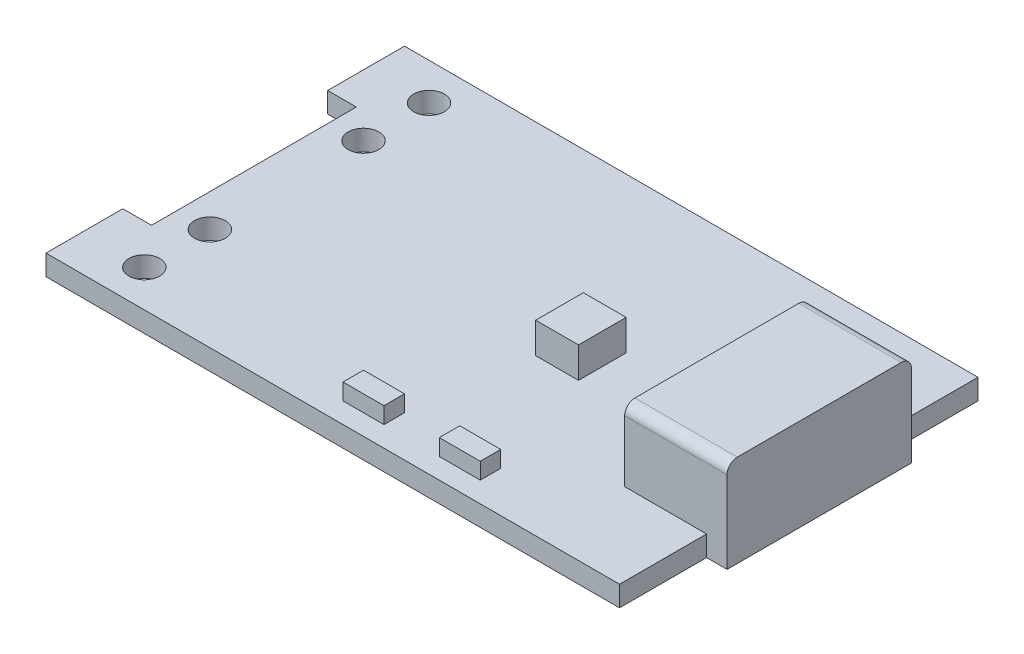
ISO-10303-21;
HEADER;
FILE_DESCRIPTION(('STEP AP214'),'2;1');
FILE_NAME('part.step','',(''),(''),'','','');
FILE_SCHEMA(('AUTOMOTIVE_DESIGN { 1 0 10303 214 1 1 1 1 }'));
ENDSEC;
DATA;
#1=APPLICATION_CONTEXT('core data for automotive mechanical design processes');
#2=APPLICATION_PROTOCOL_DEFINITION('international standard','automotive_design',2000,#1);
#3=PRODUCT_CONTEXT('',#1,'mechanical');
#4=PRODUCT('Part','Part','',(#3));
#5=PRODUCT_RELATED_PRODUCT_CATEGORY('part','',(#4));
#6=PRODUCT_DEFINITION_FORMATION('','',#4);
#7=PRODUCT_DEFINITION_CONTEXT('part definition',#1,'design');
#8=PRODUCT_DEFINITION('design','',#6,#7);
#9=PRODUCT_DEFINITION_SHAPE('','',#8);
#10=(LENGTH_UNIT() NAMED_UNIT(*) SI_UNIT(.MILLI.,.METRE.));
#11=(NAMED_UNIT(*) PLANE_ANGLE_UNIT() SI_UNIT($,.RADIAN.));
#12=(NAMED_UNIT(*) SI_UNIT($,.STERADIAN.) SOLID_ANGLE_UNIT());
#13=UNCERTAINTY_MEASURE_WITH_UNIT(LENGTH_MEASURE(1.E-05),#10,'distance_accuracy_value','');
#14=(GEOMETRIC_REPRESENTATION_CONTEXT(3) GLOBAL_UNCERTAINTY_ASSIGNED_CONTEXT((#13)) GLOBAL_UNIT_ASSIGNED_CONTEXT((#10,
#11,#12)) REPRESENTATION_CONTEXT('',''));
#15=CARTESIAN_POINT('',(0.,0.,0.));
#16=DIRECTION('',(0.,0.,1.));
#17=DIRECTION('',(1.,0.,0.));
#18=AXIS2_PLACEMENT_3D('',#15,#16,#17);
#19=CARTESIAN_POINT('',(0.,1.,0.));
#20=DIRECTION('',(0.,1.,0.));
#21=DIRECTION('',(0.,0.,1.));
#22=AXIS2_PLACEMENT_3D('',#19,#20,#21);
#23=PLANE('',#22);
#24=CARTESIAN_POINT('',(-11.,1.,-6.95));
#25=DIRECTION('',(0.,1.,0.));
#26=DIRECTION('',(0.,0.,1.));
#27=AXIS2_PLACEMENT_3D('',#24,#25,#26);
#28=CIRCLE('',#27,0.75);
#29=CARTESIAN_POINT('',(-11.,1.,-6.2));
#30=VERTEX_POINT('',#29);
#31=EDGE_CURVE('E294',#30,#30,#28,.T.);
#32=ORIENTED_EDGE('',*,*,#31,.F.);
#33=EDGE_LOOP('',(#32));
#34=FACE_BOUND('',#33,.T.);
#35=CARTESIAN_POINT('',(-11.,1.,-3.75));
#36=DIRECTION('',(0.,1.,0.));
#37=DIRECTION('',(0.,0.,1.));
#38=AXIS2_PLACEMENT_3D('',#35,#36,#37);
#39=CIRCLE('',#38,0.75);
#40=CARTESIAN_POINT('',(-11.,1.,-3.));
#41=VERTEX_POINT('',#40);
#42=EDGE_CURVE('E300',#41,#41,#39,.T.);
#43=ORIENTED_EDGE('',*,*,#42,.F.);
#44=EDGE_LOOP('',(#43));
#45=FACE_BOUND('',#44,.T.);
#46=CARTESIAN_POINT('',(-11.,1.,3.75000000000001));
#47=DIRECTION('',(0.,1.,0.));
#48=DIRECTION('',(0.,0.,-1.));
#49=AXIS2_PLACEMENT_3D('',#46,#47,#48);
#50=CIRCLE('',#49,0.75);
#51=CARTESIAN_POINT('',(-11.,1.,3.00000000000001));
#52=VERTEX_POINT('',#51);
#53=EDGE_CURVE('E306',#52,#52,#50,.T.);
#54=ORIENTED_EDGE('',*,*,#53,.F.);
#55=EDGE_LOOP('',(#54));
#56=FACE_BOUND('',#55,.T.);
#57=CARTESIAN_POINT('',(-11.,1.,6.95000000000001));
#58=DIRECTION('',(0.,1.,0.));
#59=DIRECTION('',(0.,0.,-1.));
#60=AXIS2_PLACEMENT_3D('',#57,#58,#59);
#61=CIRCLE('',#60,0.75);
#62=CARTESIAN_POINT('',(-11.,1.,6.20000000000001));
#63=VERTEX_POINT('',#62);
#64=EDGE_CURVE('E289',#63,#63,#61,.T.);
#65=ORIENTED_EDGE('',*,*,#64,.F.);
#66=EDGE_LOOP('',(#65));
#67=FACE_BOUND('',#66,.T.);
#68=DIRECTION('',(-1.,0.,0.));
#69=VECTOR('',#68,1.);
#70=CARTESIAN_POINT('',(-14.,1.,-5.));
#71=LINE('',#70,#69);
#72=CARTESIAN_POINT('',(-12.6,1.,-5.));
#73=VERTEX_POINT('',#72);
#74=CARTESIAN_POINT('',(-14.,1.,-5.));
#75=VERTEX_POINT('',#74);
#76=EDGE_CURVE('E318',#73,#75,#71,.T.);
#77=ORIENTED_EDGE('',*,*,#76,.F.);
#78=DIRECTION('',(0.,0.,-1.));
#79=VECTOR('',#78,1.);
#80=CARTESIAN_POINT('',(-12.6,1.,-5.));
#81=LINE('',#80,#79);
#82=CARTESIAN_POINT('',(-12.6,1.,5.));
#83=VERTEX_POINT('',#82);
#84=EDGE_CURVE('E327',#83,#73,#81,.T.);
#85=ORIENTED_EDGE('',*,*,#84,.F.);
#86=DIRECTION('',(1.,0.,0.));
#87=VECTOR('',#86,1.);
#88=CARTESIAN_POINT('',(-14.,1.,5.));
#89=LINE('',#88,#87);
#90=CARTESIAN_POINT('',(-14.,1.,5.));
#91=VERTEX_POINT('',#90);
#92=EDGE_CURVE('E293',#91,#83,#89,.T.);
#93=ORIENTED_EDGE('',*,*,#92,.F.);
#94=DIRECTION('',(0.,0.,1.));
#95=VECTOR('',#94,1.);
#96=CARTESIAN_POINT('',(-14.,1.,-8.75));
#97=LINE('',#96,#95);
#98=CARTESIAN_POINT('',(-14.,1.,8.75));
#99=VERTEX_POINT('',#98);
#100=EDGE_CURVE('E410',#91,#99,#97,.T.);
#101=ORIENTED_EDGE('',*,*,#100,.T.);
#102=DIRECTION('',(1.,0.,0.));
#103=VECTOR('',#102,1.);
#104=CARTESIAN_POINT('',(-14.,1.,8.75));
#105=LINE('',#104,#103);
#106=CARTESIAN_POINT('',(14.,1.,8.75));
#107=VERTEX_POINT('',#106);
#108=EDGE_CURVE('E414',#99,#107,#105,.T.);
#109=ORIENTED_EDGE('',*,*,#108,.T.);
#110=DIRECTION('',(0.,0.,-1.));
#111=VECTOR('',#110,1.);
#112=CARTESIAN_POINT('',(14.,1.,-8.75));
#113=LINE('',#112,#111);
#114=CARTESIAN_POINT('',(14.,1.,4.5));
#115=VERTEX_POINT('',#114);
#116=EDGE_CURVE('E404',#107,#115,#113,.T.);
#117=ORIENTED_EDGE('',*,*,#116,.T.);
#118=DIRECTION('',(-1.,0.,0.));
#119=VECTOR('',#118,1.);
#120=CARTESIAN_POINT('',(0.,1.,4.5));
#121=LINE('',#120,#119);
#122=CARTESIAN_POINT('',(10.,1.,4.5));
#123=VERTEX_POINT('',#122);
#124=EDGE_CURVE('E395',#115,#123,#121,.T.);
#125=ORIENTED_EDGE('',*,*,#124,.T.);
#126=DIRECTION('',(0.,0.,-1.));
#127=VECTOR('',#126,1.);
#128=CARTESIAN_POINT('',(10.,1.,0.));
#129=LINE('',#128,#127);
#130=CARTESIAN_POINT('',(10.,1.,-4.5));
#131=VERTEX_POINT('',#130);
#132=EDGE_CURVE('E400',#123,#131,#129,.T.);
#133=ORIENTED_EDGE('',*,*,#132,.T.);
#134=DIRECTION('',(1.,0.,0.));
#135=VECTOR('',#134,1.);
#136=CARTESIAN_POINT('',(0.,1.,-4.49999999999999));
#137=LINE('',#136,#135);
#138=CARTESIAN_POINT('',(14.,1.,-4.5));
#139=VERTEX_POINT('',#138);
#140=EDGE_CURVE('E390',#131,#139,#137,.T.);
#141=ORIENTED_EDGE('',*,*,#140,.T.);
#142=CARTESIAN_POINT('',(14.,1.,-8.75));
#143=VERTEX_POINT('',#142);
#144=EDGE_CURVE('E408',#139,#143,#113,.T.);
#145=ORIENTED_EDGE('',*,*,#144,.T.);
#146=DIRECTION('',(-1.,0.,0.));
#147=VECTOR('',#146,1.);
#148=CARTESIAN_POINT('',(-14.,1.,-8.75));
#149=LINE('',#148,#147);
#150=CARTESIAN_POINT('',(-14.,1.,-8.75));
#151=VERTEX_POINT('',#150);
#152=EDGE_CURVE('E407',#143,#151,#149,.T.);
#153=ORIENTED_EDGE('',*,*,#152,.T.);
#154=EDGE_CURVE('E411',#151,#75,#97,.T.);
#155=ORIENTED_EDGE('',*,*,#154,.T.);
#156=EDGE_LOOP('',(#77,#85,#93,#101,#109,#117,#125,#133,#141,#145,#153,#155));
#157=FACE_BOUND('',#156,.T.);
#158=DIRECTION('',(1.,0.,0.));
#159=VECTOR('',#158,1.);
#160=CARTESIAN_POINT('',(2.29048916127568,1.,1.13397646880793));
#161=LINE('',#160,#159);
#162=CARTESIAN_POINT('',(2.29048916127568,1.,1.13397646880793));
#163=VERTEX_POINT('',#162);
#164=CARTESIAN_POINT('',(4.37939318276397,1.,1.13397646880793));
#165=VERTEX_POINT('',#164);
#166=EDGE_CURVE('E353',#163,#165,#161,.T.);
#167=ORIENTED_EDGE('',*,*,#166,.F.);
#168=DIRECTION('',(0.,0.,1.));
#169=VECTOR('',#168,1.);
#170=CARTESIAN_POINT('',(2.29048916127568,1.,-1.19365944085045));
#171=LINE('',#170,#169);
#172=CARTESIAN_POINT('',(2.29048916127568,1.,-1.19365944085045));
#173=VERTEX_POINT('',#172);
#174=EDGE_CURVE('E334',#173,#163,#171,.T.);
#175=ORIENTED_EDGE('',*,*,#174,.F.);
#176=DIRECTION('',(-1.,0.,0.));
#177=VECTOR('',#176,1.);
#178=CARTESIAN_POINT('',(2.29048916127568,1.,-1.19365944085045));
#179=LINE('',#178,#177);
#180=CARTESIAN_POINT('',(4.37939318276397,1.,-1.19365944085045));
#181=VERTEX_POINT('',#180);
#182=EDGE_CURVE('E344',#181,#173,#179,.T.);
#183=ORIENTED_EDGE('',*,*,#182,.F.);
#184=DIRECTION('',(0.,0.,-1.));
#185=VECTOR('',#184,1.);
#186=CARTESIAN_POINT('',(4.37939318276397,1.,-1.19365944085045));
#187=LINE('',#186,#185);
#188=EDGE_CURVE('E355',#165,#181,#187,.T.);
#189=ORIENTED_EDGE('',*,*,#188,.F.);
#190=EDGE_LOOP('',(#167,#175,#183,#189));
#191=FACE_BOUND('',#190,.T.);
#192=DIRECTION('',(0.,0.,-1.));
#193=VECTOR('',#192,1.);
#194=CARTESIAN_POINT('',(4.2,1.,0.));
#195=LINE('',#194,#193);
#196=CARTESIAN_POINT('',(4.2,1.,7.75));
#197=VERTEX_POINT('',#196);
#198=CARTESIAN_POINT('',(4.2,1.,6.75));
#199=VERTEX_POINT('',#198);
#200=EDGE_CURVE('E283',#197,#199,#195,.T.);
#201=ORIENTED_EDGE('',*,*,#200,.T.);
#202=DIRECTION('',(1.,0.,0.));
#203=VECTOR('',#202,1.);
#204=CARTESIAN_POINT('',(0.,1.,6.75));
#205=LINE('',#204,#203);
#206=CARTESIAN_POINT('',(6.2,1.,6.75));
#207=VERTEX_POINT('',#206);
#208=EDGE_CURVE('E286',#199,#207,#205,.T.);
#209=ORIENTED_EDGE('',*,*,#208,.T.);
#210=DIRECTION('',(0.,0.,1.));
#211=VECTOR('',#210,1.);
#212=CARTESIAN_POINT('',(6.2,1.,0.));
#213=LINE('',#212,#211);
#214=CARTESIAN_POINT('',(6.19999999999999,1.,7.75));
#215=VERTEX_POINT('',#214);
#216=EDGE_CURVE('E277',#207,#215,#213,.T.);
#217=ORIENTED_EDGE('',*,*,#216,.T.);
#218=DIRECTION('',(-1.,0.,0.));
#219=VECTOR('',#218,1.);
#220=CARTESIAN_POINT('',(0.,1.,7.75));
#221=LINE('',#220,#219);
#222=EDGE_CURVE('E280',#215,#197,#221,.T.);
#223=ORIENTED_EDGE('',*,*,#222,.T.);
#224=EDGE_LOOP('',(#201,#209,#217,#223));
#225=FACE_BOUND('',#224,.T.);
#226=DIRECTION('',(0.,0.,-1.));
#227=VECTOR('',#226,1.);
#228=CARTESIAN_POINT('',(-0.500000000000005,1.,0.));
#229=LINE('',#228,#227);
#230=CARTESIAN_POINT('',(-0.500000000000005,1.,7.75));
#231=VERTEX_POINT('',#230);
#232=CARTESIAN_POINT('',(-0.500000000000005,1.,6.75));
#233=VERTEX_POINT('',#232);
#234=EDGE_CURVE('E255',#231,#233,#229,.T.);
#235=ORIENTED_EDGE('',*,*,#234,.T.);
#236=DIRECTION('',(1.,0.,0.));
#237=VECTOR('',#236,1.);
#238=CARTESIAN_POINT('',(0.,1.,6.75));
#239=LINE('',#238,#237);
#240=CARTESIAN_POINT('',(1.5,1.,6.75));
#241=VERTEX_POINT('',#240);
#242=EDGE_CURVE('E244',#233,#241,#239,.T.);
#243=ORIENTED_EDGE('',*,*,#242,.T.);
#244=DIRECTION('',(0.,0.,1.));
#245=VECTOR('',#244,1.);
#246=CARTESIAN_POINT('',(1.5,1.,0.));
#247=LINE('',#246,#245);
#248=CARTESIAN_POINT('',(1.49999999999999,1.,7.75));
#249=VERTEX_POINT('',#248);
#250=EDGE_CURVE('E245',#241,#249,#247,.T.);
#251=ORIENTED_EDGE('',*,*,#250,.T.);
#252=DIRECTION('',(-1.,0.,0.));
#253=VECTOR('',#252,1.);
#254=CARTESIAN_POINT('',(0.,1.,7.75));
#255=LINE('',#254,#253);
#256=EDGE_CURVE('E248',#249,#231,#255,.T.);
#257=ORIENTED_EDGE('',*,*,#256,.T.);
#258=EDGE_LOOP('',(#235,#243,#251,#257));
#259=FACE_BOUND('',#258,.T.);
#260=ADVANCED_FACE('F36',(#34,#45,#56,#67,#157,#191,#225,#259),#23,.T.);
#261=CARTESIAN_POINT('',(-14.,1.,-8.75));
#262=DIRECTION('',(1.,0.,0.));
#263=DIRECTION('',(0.,0.,-1.));
#264=AXIS2_PLACEMENT_3D('',#261,#262,#263);
#265=PLANE('',#264);
#266=DIRECTION('',(0.,0.,1.));
#267=VECTOR('',#266,1.);
#268=CARTESIAN_POINT('',(-14.,0.,-8.75));
#269=LINE('',#268,#267);
#270=CARTESIAN_POINT('',(-14.,0.,-8.75));
#271=VERTEX_POINT('',#270);
#272=CARTESIAN_POINT('',(-14.,0.,-5.));
#273=VERTEX_POINT('',#272);
#274=EDGE_CURVE('E423',#271,#273,#269,.T.);
#275=ORIENTED_EDGE('',*,*,#274,.T.);
#276=DIRECTION('',(0.,1.,0.));
#277=VECTOR('',#276,1.);
#278=CARTESIAN_POINT('',(-14.,0.,-5.));
#279=LINE('',#278,#277);
#280=EDGE_CURVE('E331',#273,#75,#279,.T.);
#281=ORIENTED_EDGE('',*,*,#280,.T.);
#282=ORIENTED_EDGE('',*,*,#154,.F.);
#283=DIRECTION('',(0.,-1.,0.));
#284=VECTOR('',#283,1.);
#285=CARTESIAN_POINT('',(-14.,1.,-8.75));
#286=LINE('',#285,#284);
#287=EDGE_CURVE('E433',#151,#271,#286,.T.);
#288=ORIENTED_EDGE('',*,*,#287,.T.);
#289=EDGE_LOOP('',(#275,#281,#282,#288));
#290=FACE_BOUND('',#289,.T.);
#291=ADVANCED_FACE('F503',(#290),#265,.F.);
#292=CARTESIAN_POINT('',(14.,1.,-8.75));
#293=DIRECTION('',(-1.,0.,0.));
#294=DIRECTION('',(0.,0.,1.));
#295=AXIS2_PLACEMENT_3D('',#292,#293,#294);
#296=PLANE('',#295);
#297=DIRECTION('',(0.,-1.,0.));
#298=VECTOR('',#297,1.);
#299=CARTESIAN_POINT('',(14.,1.,4.5));
#300=LINE('',#299,#298);
#301=CARTESIAN_POINT('',(14.,0.,4.5));
#302=VERTEX_POINT('',#301);
#303=EDGE_CURVE('E398',#115,#302,#300,.T.);
#304=ORIENTED_EDGE('',*,*,#303,.F.);
#305=ORIENTED_EDGE('',*,*,#116,.F.);
#306=DIRECTION('',(0.,-1.,0.));
#307=VECTOR('',#306,1.);
#308=CARTESIAN_POINT('',(14.,1.,8.75));
#309=LINE('',#308,#307);
#310=CARTESIAN_POINT('',(14.,0.,8.75));
#311=VERTEX_POINT('',#310);
#312=EDGE_CURVE('E416',#107,#311,#309,.T.);
#313=ORIENTED_EDGE('',*,*,#312,.T.);
#314=DIRECTION('',(0.,0.,-1.));
#315=VECTOR('',#314,1.);
#316=CARTESIAN_POINT('',(14.,0.,-8.75));
#317=LINE('',#316,#315);
#318=EDGE_CURVE('E417',#311,#302,#317,.T.);
#319=ORIENTED_EDGE('',*,*,#318,.T.);
#320=EDGE_LOOP('',(#304,#305,#313,#319));
#321=FACE_BOUND('',#320,.T.);
#322=ADVANCED_FACE('F527',(#321),#296,.F.);
#323=DIRECTION('',(0.,1.,0.));
#324=VECTOR('',#323,1.);
#325=CARTESIAN_POINT('',(14.,1.,-4.5));
#326=LINE('',#325,#324);
#327=CARTESIAN_POINT('',(14.,0.,-4.5));
#328=VERTEX_POINT('',#327);
#329=EDGE_CURVE('E393',#328,#139,#326,.T.);
#330=ORIENTED_EDGE('',*,*,#329,.F.);
#331=CARTESIAN_POINT('',(14.,0.,-8.75));
#332=VERTEX_POINT('',#331);
#333=EDGE_CURVE('E403',#328,#332,#317,.T.);
#334=ORIENTED_EDGE('',*,*,#333,.T.);
#335=DIRECTION('',(0.,-1.,0.));
#336=VECTOR('',#335,1.);
#337=CARTESIAN_POINT('',(14.,1.,-8.75));
#338=LINE('',#337,#336);
#339=EDGE_CURVE('E436',#143,#332,#338,.T.);
#340=ORIENTED_EDGE('',*,*,#339,.F.);
#341=ORIENTED_EDGE('',*,*,#144,.F.);
#342=EDGE_LOOP('',(#330,#334,#340,#341));
#343=FACE_BOUND('',#342,.T.);
#344=ADVANCED_FACE('F494',(#343),#296,.F.);
#345=CARTESIAN_POINT('',(-14.,1.,-8.75));
#346=DIRECTION('',(0.,0.,1.));
#347=DIRECTION('',(1.,0.,0.));
#348=AXIS2_PLACEMENT_3D('',#345,#346,#347);
#349=PLANE('',#348);
#350=DIRECTION('',(-1.,0.,0.));
#351=VECTOR('',#350,1.);
#352=CARTESIAN_POINT('',(-14.,0.,-8.75));
#353=LINE('',#352,#351);
#354=EDGE_CURVE('E420',#332,#271,#353,.T.);
#355=ORIENTED_EDGE('',*,*,#354,.T.);
#356=ORIENTED_EDGE('',*,*,#287,.F.);
#357=ORIENTED_EDGE('',*,*,#152,.F.);
#358=ORIENTED_EDGE('',*,*,#339,.T.);
#359=EDGE_LOOP('',(#355,#356,#357,#358));
#360=FACE_BOUND('',#359,.T.);
#361=ADVANCED_FACE('F499',(#360),#349,.F.);
#362=ORIENTED_EDGE('',*,*,#100,.F.);
#363=DIRECTION('',(0.,1.,0.));
#364=VECTOR('',#363,1.);
#365=CARTESIAN_POINT('',(-14.,0.,5.));
#366=LINE('',#365,#364);
#367=CARTESIAN_POINT('',(-14.,0.,5.));
#368=VERTEX_POINT('',#367);
#369=EDGE_CURVE('E324',#368,#91,#366,.T.);
#370=ORIENTED_EDGE('',*,*,#369,.F.);
#371=CARTESIAN_POINT('',(-14.,0.,8.75));
#372=VERTEX_POINT('',#371);
#373=EDGE_CURVE('E422',#368,#372,#269,.T.);
#374=ORIENTED_EDGE('',*,*,#373,.T.);
#375=DIRECTION('',(0.,-1.,0.));
#376=VECTOR('',#375,1.);
#377=CARTESIAN_POINT('',(-14.,1.,8.75));
#378=LINE('',#377,#376);
#379=EDGE_CURVE('E430',#99,#372,#378,.T.);
#380=ORIENTED_EDGE('',*,*,#379,.F.);
#381=EDGE_LOOP('',(#362,#370,#374,#380));
#382=FACE_BOUND('',#381,.T.);
#383=ADVANCED_FACE('F518',(#382),#265,.F.);
#384=CARTESIAN_POINT('',(-14.,1.,8.75));
#385=DIRECTION('',(0.,0.,-1.));
#386=DIRECTION('',(-1.,0.,0.));
#387=AXIS2_PLACEMENT_3D('',#384,#385,#386);
#388=PLANE('',#387);
#389=DIRECTION('',(1.,0.,0.));
#390=VECTOR('',#389,1.);
#391=CARTESIAN_POINT('',(-14.,0.,8.75));
#392=LINE('',#391,#390);
#393=EDGE_CURVE('E426',#372,#311,#392,.T.);
#394=ORIENTED_EDGE('',*,*,#393,.T.);
#395=ORIENTED_EDGE('',*,*,#312,.F.);
#396=ORIENTED_EDGE('',*,*,#108,.F.);
#397=ORIENTED_EDGE('',*,*,#379,.T.);
#398=EDGE_LOOP('',(#394,#395,#396,#397));
#399=FACE_BOUND('',#398,.T.);
#400=ADVANCED_FACE('F524',(#399),#388,.F.);
#401=CARTESIAN_POINT('',(0.,0.,0.));
#402=DIRECTION('',(0.,1.,0.));
#403=DIRECTION('',(0.,0.,1.));
#404=AXIS2_PLACEMENT_3D('',#401,#402,#403);
#405=PLANE('',#404);
#406=CARTESIAN_POINT('',(-11.,0.,-6.95));
#407=DIRECTION('',(0.,1.,0.));
#408=DIRECTION('',(0.,0.,1.));
#409=AXIS2_PLACEMENT_3D('',#406,#407,#408);
#410=CIRCLE('',#409,0.75);
#411=CARTESIAN_POINT('',(-11.,0.,-6.2));
#412=VERTEX_POINT('',#411);
#413=EDGE_CURVE('E290',#412,#412,#410,.T.);
#414=ORIENTED_EDGE('',*,*,#413,.T.);
#415=EDGE_LOOP('',(#414));
#416=FACE_BOUND('',#415,.T.);
#417=CARTESIAN_POINT('',(-11.,0.,-3.75));
#418=DIRECTION('',(0.,1.,0.));
#419=DIRECTION('',(0.,0.,1.));
#420=AXIS2_PLACEMENT_3D('',#417,#418,#419);
#421=CIRCLE('',#420,0.75);
#422=CARTESIAN_POINT('',(-11.,0.,-3.));
#423=VERTEX_POINT('',#422);
#424=EDGE_CURVE('E297',#423,#423,#421,.T.);
#425=ORIENTED_EDGE('',*,*,#424,.T.);
#426=EDGE_LOOP('',(#425));
#427=FACE_BOUND('',#426,.T.);
#428=CARTESIAN_POINT('',(-11.,0.,3.75000000000001));
#429=DIRECTION('',(0.,1.,0.));
#430=DIRECTION('',(0.,0.,-1.));
#431=AXIS2_PLACEMENT_3D('',#428,#429,#430);
#432=CIRCLE('',#431,0.75);
#433=CARTESIAN_POINT('',(-11.,0.,3.00000000000001));
#434=VERTEX_POINT('',#433);
#435=EDGE_CURVE('E303',#434,#434,#432,.T.);
#436=ORIENTED_EDGE('',*,*,#435,.T.);
#437=EDGE_LOOP('',(#436));
#438=FACE_BOUND('',#437,.T.);
#439=CARTESIAN_POINT('',(-11.,0.,6.95000000000001));
#440=DIRECTION('',(0.,1.,0.));
#441=DIRECTION('',(0.,0.,-1.));
#442=AXIS2_PLACEMENT_3D('',#439,#440,#441);
#443=CIRCLE('',#442,0.75);
#444=CARTESIAN_POINT('',(-11.,0.,6.20000000000001));
#445=VERTEX_POINT('',#444);
#446=EDGE_CURVE('E309',#445,#445,#443,.T.);
#447=ORIENTED_EDGE('',*,*,#446,.T.);
#448=EDGE_LOOP('',(#447));
#449=FACE_BOUND('',#448,.T.);
#450=DIRECTION('',(0.,0.,-1.));
#451=VECTOR('',#450,1.);
#452=CARTESIAN_POINT('',(-12.6,0.,-5.));
#453=LINE('',#452,#451);
#454=CARTESIAN_POINT('',(-12.6,0.,5.));
#455=VERTEX_POINT('',#454);
#456=CARTESIAN_POINT('',(-12.6,0.,-5.));
#457=VERTEX_POINT('',#456);
#458=EDGE_CURVE('E317',#455,#457,#453,.T.);
#459=ORIENTED_EDGE('',*,*,#458,.T.);
#460=DIRECTION('',(-1.,0.,0.));
#461=VECTOR('',#460,1.);
#462=CARTESIAN_POINT('',(-14.,0.,-5.));
#463=LINE('',#462,#461);
#464=EDGE_CURVE('E321',#457,#273,#463,.T.);
#465=ORIENTED_EDGE('',*,*,#464,.T.);
#466=ORIENTED_EDGE('',*,*,#274,.F.);
#467=ORIENTED_EDGE('',*,*,#354,.F.);
#468=ORIENTED_EDGE('',*,*,#333,.F.);
#469=DIRECTION('',(-1.,0.,0.));
#470=VECTOR('',#469,1.);
#471=CARTESIAN_POINT('',(0.,0.,-4.49999999999999));
#472=LINE('',#471,#470);
#473=CARTESIAN_POINT('',(15.,0.,-4.5));
#474=VERTEX_POINT('',#473);
#475=EDGE_CURVE('E373',#474,#328,#472,.T.);
#476=ORIENTED_EDGE('',*,*,#475,.F.);
#477=DIRECTION('',(0.,0.,-1.));
#478=VECTOR('',#477,1.);
#479=CARTESIAN_POINT('',(15.,0.,0.));
#480=LINE('',#479,#478);
#481=CARTESIAN_POINT('',(15.,0.,4.5));
#482=VERTEX_POINT('',#481);
#483=EDGE_CURVE('E379',#482,#474,#480,.T.);
#484=ORIENTED_EDGE('',*,*,#483,.F.);
#485=DIRECTION('',(1.,0.,0.));
#486=VECTOR('',#485,1.);
#487=CARTESIAN_POINT('',(0.,0.,4.5));
#488=LINE('',#487,#486);
#489=EDGE_CURVE('E368',#302,#482,#488,.T.);
#490=ORIENTED_EDGE('',*,*,#489,.F.);
#491=ORIENTED_EDGE('',*,*,#318,.F.);
#492=ORIENTED_EDGE('',*,*,#393,.F.);
#493=ORIENTED_EDGE('',*,*,#373,.F.);
#494=DIRECTION('',(1.,0.,0.));
#495=VECTOR('',#494,1.);
#496=CARTESIAN_POINT('',(-14.,0.,5.));
#497=LINE('',#496,#495);
#498=EDGE_CURVE('E314',#368,#455,#497,.T.);
#499=ORIENTED_EDGE('',*,*,#498,.T.);
#500=EDGE_LOOP('',(#459,#465,#466,#467,#468,#476,#484,#490,#491,#492,#493,#499));
#501=FACE_BOUND('',#500,.T.);
#502=ADVANCED_FACE('F490',(#416,#427,#438,#449,#501),#405,.F.);
#503=CARTESIAN_POINT('',(0.,4.5,4.5));
#504=DIRECTION('',(0.,0.,-1.));
#505=DIRECTION('',(-1.,0.,0.));
#506=AXIS2_PLACEMENT_3D('',#503,#504,#505);
#507=PLANE('',#506);
#508=DIRECTION('',(0.,-1.,0.));
#509=VECTOR('',#508,1.);
#510=CARTESIAN_POINT('',(15.,4.5,4.5));
#511=LINE('',#510,#509);
#512=CARTESIAN_POINT('',(15.,4.,4.5));
#513=VERTEX_POINT('',#512);
#514=EDGE_CURVE('E386',#513,#482,#511,.T.);
#515=ORIENTED_EDGE('',*,*,#514,.F.);
#516=DIRECTION('',(1.,0.,0.));
#517=VECTOR('',#516,1.);
#518=CARTESIAN_POINT('',(10.,4.,4.5));
#519=LINE('',#518,#517);
#520=CARTESIAN_POINT('',(10.,4.,4.5));
#521=VERTEX_POINT('',#520);
#522=EDGE_CURVE('E11',#513,#521,#519,.F.);
#523=ORIENTED_EDGE('',*,*,#522,.T.);
#524=DIRECTION('',(0.,-1.,0.));
#525=VECTOR('',#524,1.);
#526=CARTESIAN_POINT('',(10.,4.5,4.5));
#527=LINE('',#526,#525);
#528=EDGE_CURVE('E388',#521,#123,#527,.T.);
#529=ORIENTED_EDGE('',*,*,#528,.T.);
#530=ORIENTED_EDGE('',*,*,#124,.F.);
#531=ORIENTED_EDGE('',*,*,#303,.T.);
#532=ORIENTED_EDGE('',*,*,#489,.T.);
#533=EDGE_LOOP('',(#515,#523,#529,#530,#531,#532));
#534=FACE_BOUND('',#533,.T.);
#535=ADVANCED_FACE('F483',(#534),#507,.F.);
#536=CARTESIAN_POINT('',(0.,4.5,-4.49999999999999));
#537=DIRECTION('',(0.,0.,1.));
#538=DIRECTION('',(1.,0.,0.));
#539=AXIS2_PLACEMENT_3D('',#536,#537,#538);
#540=PLANE('',#539);
#541=DIRECTION('',(0.,-1.,0.));
#542=VECTOR('',#541,1.);
#543=CARTESIAN_POINT('',(10.,4.5,-4.5));
#544=LINE('',#543,#542);
#545=CARTESIAN_POINT('',(10.,4.,-4.5));
#546=VERTEX_POINT('',#545);
#547=EDGE_CURVE('E376',#546,#131,#544,.T.);
#548=ORIENTED_EDGE('',*,*,#547,.F.);
#549=DIRECTION('',(-1.,0.,0.));
#550=VECTOR('',#549,1.);
#551=CARTESIAN_POINT('',(15.,4.,-4.5));
#552=LINE('',#551,#550);
#553=CARTESIAN_POINT('',(15.,4.,-4.5));
#554=VERTEX_POINT('',#553);
#555=EDGE_CURVE('E449',#546,#554,#552,.F.);
#556=ORIENTED_EDGE('',*,*,#555,.T.);
#557=DIRECTION('',(0.,-1.,0.));
#558=VECTOR('',#557,1.);
#559=CARTESIAN_POINT('',(15.,4.5,-4.5));
#560=LINE('',#559,#558);
#561=EDGE_CURVE('E384',#554,#474,#560,.T.);
#562=ORIENTED_EDGE('',*,*,#561,.T.);
#563=ORIENTED_EDGE('',*,*,#475,.T.);
#564=ORIENTED_EDGE('',*,*,#329,.T.);
#565=ORIENTED_EDGE('',*,*,#140,.F.);
#566=EDGE_LOOP('',(#548,#556,#562,#563,#564,#565));
#567=FACE_BOUND('',#566,.T.);
#568=ADVANCED_FACE('F471',(#567),#540,.F.);
#569=CARTESIAN_POINT('',(10.,4.5,0.));
#570=DIRECTION('',(1.,0.,0.));
#571=DIRECTION('',(0.,0.,-1.));
#572=AXIS2_PLACEMENT_3D('',#569,#570,#571);
#573=PLANE('',#572);
#574=DIRECTION('',(0.,0.,1.));
#575=VECTOR('',#574,1.);
#576=CARTESIAN_POINT('',(10.,4.5,0.));
#577=LINE('',#576,#575);
#578=CARTESIAN_POINT('',(10.,4.5,-4.));
#579=VERTEX_POINT('',#578);
#580=CARTESIAN_POINT('',(10.,4.5,4.));
#581=VERTEX_POINT('',#580);
#582=EDGE_CURVE('E369',#579,#581,#577,.T.);
#583=ORIENTED_EDGE('',*,*,#582,.F.);
#584=CARTESIAN_POINT('',(10.,4.,-4.));
#585=DIRECTION('',(1.,0.,0.));
#586=DIRECTION('',(0.,0.,-1.));
#587=AXIS2_PLACEMENT_3D('',#584,#585,#586);
#588=CIRCLE('',#587,0.5);
#589=EDGE_CURVE('E447',#579,#546,#588,.F.);
#590=ORIENTED_EDGE('',*,*,#589,.T.);
#591=ORIENTED_EDGE('',*,*,#547,.T.);
#592=ORIENTED_EDGE('',*,*,#132,.F.);
#593=ORIENTED_EDGE('',*,*,#528,.F.);
#594=CARTESIAN_POINT('',(10.,4.,4.));
#595=DIRECTION('',(1.,0.,0.));
#596=DIRECTION('',(0.,0.,-1.));
#597=AXIS2_PLACEMENT_3D('',#594,#595,#596);
#598=CIRCLE('',#597,0.5);
#599=EDGE_CURVE('E445',#521,#581,#598,.F.);
#600=ORIENTED_EDGE('',*,*,#599,.T.);
#601=EDGE_LOOP('',(#583,#590,#591,#592,#593,#600));
#602=FACE_BOUND('',#601,.T.);
#603=ADVANCED_FACE('F467',(#602),#573,.F.);
#604=CARTESIAN_POINT('',(15.,4.5,0.));
#605=DIRECTION('',(-1.,0.,0.));
#606=DIRECTION('',(0.,0.,1.));
#607=AXIS2_PLACEMENT_3D('',#604,#605,#606);
#608=PLANE('',#607);
#609=ORIENTED_EDGE('',*,*,#561,.F.);
#610=CARTESIAN_POINT('',(15.,4.,-4.));
#611=DIRECTION('',(-1.,0.,0.));
#612=DIRECTION('',(0.,0.,1.));
#613=AXIS2_PLACEMENT_3D('',#610,#611,#612);
#614=CIRCLE('',#613,0.5);
#615=CARTESIAN_POINT('',(15.,4.5,-4.));
#616=VERTEX_POINT('',#615);
#617=EDGE_CURVE('E44',#554,#616,#614,.F.);
#618=ORIENTED_EDGE('',*,*,#617,.T.);
#619=DIRECTION('',(0.,0.,-1.));
#620=VECTOR('',#619,1.);
#621=CARTESIAN_POINT('',(15.,4.5,0.));
#622=LINE('',#621,#620);
#623=CARTESIAN_POINT('',(15.,4.5,4.));
#624=VERTEX_POINT('',#623);
#625=EDGE_CURVE('E372',#624,#616,#622,.T.);
#626=ORIENTED_EDGE('',*,*,#625,.F.);
#627=CARTESIAN_POINT('',(15.,4.,4.));
#628=DIRECTION('',(-1.,0.,0.));
#629=DIRECTION('',(0.,0.,1.));
#630=AXIS2_PLACEMENT_3D('',#627,#628,#629);
#631=CIRCLE('',#630,0.5);
#632=EDGE_CURVE('E451',#624,#513,#631,.F.);
#633=ORIENTED_EDGE('',*,*,#632,.T.);
#634=ORIENTED_EDGE('',*,*,#514,.T.);
#635=ORIENTED_EDGE('',*,*,#483,.T.);
#636=EDGE_LOOP('',(#609,#618,#626,#633,#634,#635));
#637=FACE_BOUND('',#636,.T.);
#638=ADVANCED_FACE('F456',(#637),#608,.F.);
#639=CARTESIAN_POINT('',(0.,4.5,0.));
#640=DIRECTION('',(0.,1.,0.));
#641=DIRECTION('',(0.,0.,1.));
#642=AXIS2_PLACEMENT_3D('',#639,#640,#641);
#643=PLANE('',#642);
#644=ORIENTED_EDGE('',*,*,#625,.T.);
#645=DIRECTION('',(-1.,0.,0.));
#646=VECTOR('',#645,1.);
#647=CARTESIAN_POINT('',(10.,4.5,-4.));
#648=LINE('',#647,#646);
#649=EDGE_CURVE('E442',#616,#579,#648,.T.);
#650=ORIENTED_EDGE('',*,*,#649,.T.);
#651=ORIENTED_EDGE('',*,*,#582,.T.);
#652=DIRECTION('',(1.,0.,0.));
#653=VECTOR('',#652,1.);
#654=CARTESIAN_POINT('',(15.,4.5,4.));
#655=LINE('',#654,#653);
#656=EDGE_CURVE('E439',#581,#624,#655,.T.);
#657=ORIENTED_EDGE('',*,*,#656,.T.);
#658=EDGE_LOOP('',(#644,#650,#651,#657));
#659=FACE_BOUND('',#658,.T.);
#660=ADVANCED_FACE('F461',(#659),#643,.T.);
#661=CARTESIAN_POINT('',(0.,4.,-3.99999999999999));
#662=DIRECTION('',(1.,0.,0.));
#663=DIRECTION('',(0.,0.,-1.));
#664=AXIS2_PLACEMENT_3D('',#661,#662,#663);
#665=CYLINDRICAL_SURFACE('',#664,0.5);
#666=ORIENTED_EDGE('',*,*,#617,.F.);
#667=ORIENTED_EDGE('',*,*,#555,.F.);
#668=ORIENTED_EDGE('',*,*,#589,.F.);
#669=ORIENTED_EDGE('',*,*,#649,.F.);
#670=EDGE_LOOP('',(#666,#667,#668,#669));
#671=FACE_BOUND('',#670,.T.);
#672=ADVANCED_FACE('F464',(#671),#665,.T.);
#673=CARTESIAN_POINT('',(0.,4.,4.));
#674=DIRECTION('',(-1.,0.,0.));
#675=DIRECTION('',(0.,0.,1.));
#676=AXIS2_PLACEMENT_3D('',#673,#674,#675);
#677=CYLINDRICAL_SURFACE('',#676,0.5);
#678=ORIENTED_EDGE('',*,*,#599,.F.);
#679=ORIENTED_EDGE('',*,*,#522,.F.);
#680=ORIENTED_EDGE('',*,*,#632,.F.);
#681=ORIENTED_EDGE('',*,*,#656,.F.);
#682=EDGE_LOOP('',(#678,#679,#680,#681));
#683=FACE_BOUND('',#682,.T.);
#684=ADVANCED_FACE('F38',(#683),#677,.T.);
#685=CARTESIAN_POINT('',(2.29048916127568,2.5,-1.19365944085045));
#686=DIRECTION('',(1.,0.,0.));
#687=DIRECTION('',(0.,0.,-1.));
#688=AXIS2_PLACEMENT_3D('',#685,#686,#687);
#689=PLANE('',#688);
#690=ORIENTED_EDGE('',*,*,#174,.T.);
#691=DIRECTION('',(0.,-1.,0.));
#692=VECTOR('',#691,1.);
#693=CARTESIAN_POINT('',(2.29048916127568,2.5,1.13397646880793));
#694=LINE('',#693,#692);
#695=CARTESIAN_POINT('',(2.29048916127568,2.5,1.13397646880793));
#696=VERTEX_POINT('',#695);
#697=EDGE_CURVE('E366',#696,#163,#694,.T.);
#698=ORIENTED_EDGE('',*,*,#697,.F.);
#699=DIRECTION('',(0.,0.,1.));
#700=VECTOR('',#699,1.);
#701=CARTESIAN_POINT('',(2.29048916127568,2.5,-1.19365944085045));
#702=LINE('',#701,#700);
#703=CARTESIAN_POINT('',(2.29048916127568,2.5,-1.19365944085045));
#704=VERTEX_POINT('',#703);
#705=EDGE_CURVE('E340',#704,#696,#702,.T.);
#706=ORIENTED_EDGE('',*,*,#705,.F.);
#707=DIRECTION('',(0.,-1.,0.));
#708=VECTOR('',#707,1.);
#709=CARTESIAN_POINT('',(2.29048916127568,2.5,-1.19365944085045));
#710=LINE('',#709,#708);
#711=EDGE_CURVE('E350',#704,#173,#710,.T.);
#712=ORIENTED_EDGE('',*,*,#711,.T.);
#713=EDGE_LOOP('',(#690,#698,#706,#712));
#714=FACE_BOUND('',#713,.T.);
#715=ADVANCED_FACE('F610',(#714),#689,.F.);
#716=CARTESIAN_POINT('',(2.29048916127568,2.5,1.13397646880793));
#717=DIRECTION('',(0.,0.,-1.));
#718=DIRECTION('',(-1.,0.,0.));
#719=AXIS2_PLACEMENT_3D('',#716,#717,#718);
#720=PLANE('',#719);
#721=ORIENTED_EDGE('',*,*,#166,.T.);
#722=DIRECTION('',(0.,-1.,0.));
#723=VECTOR('',#722,1.);
#724=CARTESIAN_POINT('',(4.37939318276397,2.5,1.13397646880793));
#725=LINE('',#724,#723);
#726=CARTESIAN_POINT('',(4.37939318276397,2.5,1.13397646880793));
#727=VERTEX_POINT('',#726);
#728=EDGE_CURVE('E363',#727,#165,#725,.T.);
#729=ORIENTED_EDGE('',*,*,#728,.F.);
#730=DIRECTION('',(1.,0.,0.));
#731=VECTOR('',#730,1.);
#732=CARTESIAN_POINT('',(2.29048916127568,2.5,1.13397646880793));
#733=LINE('',#732,#731);
#734=EDGE_CURVE('E343',#696,#727,#733,.T.);
#735=ORIENTED_EDGE('',*,*,#734,.F.);
#736=ORIENTED_EDGE('',*,*,#697,.T.);
#737=EDGE_LOOP('',(#721,#729,#735,#736));
#738=FACE_BOUND('',#737,.T.);
#739=ADVANCED_FACE('F616',(#738),#720,.F.);
#740=CARTESIAN_POINT('',(4.37939318276397,2.5,-1.19365944085045));
#741=DIRECTION('',(-1.,0.,0.));
#742=DIRECTION('',(0.,0.,1.));
#743=AXIS2_PLACEMENT_3D('',#740,#741,#742);
#744=PLANE('',#743);
#745=ORIENTED_EDGE('',*,*,#188,.T.);
#746=DIRECTION('',(0.,-1.,0.));
#747=VECTOR('',#746,1.);
#748=CARTESIAN_POINT('',(4.37939318276397,2.5,-1.19365944085045));
#749=LINE('',#748,#747);
#750=CARTESIAN_POINT('',(4.37939318276397,2.5,-1.19365944085045));
#751=VERTEX_POINT('',#750);
#752=EDGE_CURVE('E361',#751,#181,#749,.T.);
#753=ORIENTED_EDGE('',*,*,#752,.F.);
#754=DIRECTION('',(0.,0.,-1.));
#755=VECTOR('',#754,1.);
#756=CARTESIAN_POINT('',(4.37939318276397,2.5,-1.19365944085045));
#757=LINE('',#756,#755);
#758=EDGE_CURVE('E346',#727,#751,#757,.T.);
#759=ORIENTED_EDGE('',*,*,#758,.F.);
#760=ORIENTED_EDGE('',*,*,#728,.T.);
#761=EDGE_LOOP('',(#745,#753,#759,#760));
#762=FACE_BOUND('',#761,.T.);
#763=ADVANCED_FACE('F624',(#762),#744,.F.);
#764=CARTESIAN_POINT('',(2.29048916127568,2.5,-1.19365944085045));
#765=DIRECTION('',(0.,0.,1.));
#766=DIRECTION('',(1.,0.,0.));
#767=AXIS2_PLACEMENT_3D('',#764,#765,#766);
#768=PLANE('',#767);
#769=ORIENTED_EDGE('',*,*,#182,.T.);
#770=ORIENTED_EDGE('',*,*,#711,.F.);
#771=DIRECTION('',(-1.,0.,0.));
#772=VECTOR('',#771,1.);
#773=CARTESIAN_POINT('',(2.29048916127568,2.5,-1.19365944085045));
#774=LINE('',#773,#772);
#775=EDGE_CURVE('E348',#751,#704,#774,.T.);
#776=ORIENTED_EDGE('',*,*,#775,.F.);
#777=ORIENTED_EDGE('',*,*,#752,.T.);
#778=EDGE_LOOP('',(#769,#770,#776,#777));
#779=FACE_BOUND('',#778,.T.);
#780=ADVANCED_FACE('F632',(#779),#768,.F.);
#781=CARTESIAN_POINT('',(0.,2.5,0.));
#782=DIRECTION('',(0.,1.,0.));
#783=DIRECTION('',(0.,0.,1.));
#784=AXIS2_PLACEMENT_3D('',#781,#782,#783);
#785=PLANE('',#784);
#786=ORIENTED_EDGE('',*,*,#705,.T.);
#787=ORIENTED_EDGE('',*,*,#734,.T.);
#788=ORIENTED_EDGE('',*,*,#758,.T.);
#789=ORIENTED_EDGE('',*,*,#775,.T.);
#790=EDGE_LOOP('',(#786,#787,#788,#789));
#791=FACE_BOUND('',#790,.T.);
#792=ADVANCED_FACE('F640',(#791),#785,.T.);
#793=CARTESIAN_POINT('',(-14.,0.,-5.));
#794=DIRECTION('',(0.,0.,-1.));
#795=DIRECTION('',(-1.,0.,0.));
#796=AXIS2_PLACEMENT_3D('',#793,#794,#795);
#797=PLANE('',#796);
#798=ORIENTED_EDGE('',*,*,#76,.T.);
#799=ORIENTED_EDGE('',*,*,#280,.F.);
#800=ORIENTED_EDGE('',*,*,#464,.F.);
#801=DIRECTION('',(0.,1.,0.));
#802=VECTOR('',#801,1.);
#803=CARTESIAN_POINT('',(-12.6,0.,-5.));
#804=LINE('',#803,#802);
#805=EDGE_CURVE('E335',#457,#73,#804,.T.);
#806=ORIENTED_EDGE('',*,*,#805,.T.);
#807=EDGE_LOOP('',(#798,#799,#800,#806));
#808=FACE_BOUND('',#807,.T.);
#809=ADVANCED_FACE('F507',(#808),#797,.F.);
#810=CARTESIAN_POINT('',(-12.6,0.,-5.));
#811=DIRECTION('',(1.,0.,0.));
#812=DIRECTION('',(0.,0.,-1.));
#813=AXIS2_PLACEMENT_3D('',#810,#811,#812);
#814=PLANE('',#813);
#815=ORIENTED_EDGE('',*,*,#84,.T.);
#816=ORIENTED_EDGE('',*,*,#805,.F.);
#817=ORIENTED_EDGE('',*,*,#458,.F.);
#818=DIRECTION('',(0.,1.,0.));
#819=VECTOR('',#818,1.);
#820=CARTESIAN_POINT('',(-12.6,0.,5.));
#821=LINE('',#820,#819);
#822=EDGE_CURVE('E337',#455,#83,#821,.T.);
#823=ORIENTED_EDGE('',*,*,#822,.T.);
#824=EDGE_LOOP('',(#815,#816,#817,#823));
#825=FACE_BOUND('',#824,.T.);
#826=ADVANCED_FACE('F510',(#825),#814,.F.);
#827=CARTESIAN_POINT('',(-14.,0.,5.));
#828=DIRECTION('',(0.,0.,1.));
#829=DIRECTION('',(1.,0.,0.));
#830=AXIS2_PLACEMENT_3D('',#827,#828,#829);
#831=PLANE('',#830);
#832=ORIENTED_EDGE('',*,*,#92,.T.);
#833=ORIENTED_EDGE('',*,*,#822,.F.);
#834=ORIENTED_EDGE('',*,*,#498,.F.);
#835=ORIENTED_EDGE('',*,*,#369,.T.);
#836=EDGE_LOOP('',(#832,#833,#834,#835));
#837=FACE_BOUND('',#836,.T.);
#838=ADVANCED_FACE('F513',(#837),#831,.F.);
#839=CARTESIAN_POINT('',(-11.,0.,6.95000000000001));
#840=DIRECTION('',(0.,1.,0.));
#841=DIRECTION('',(0.,0.,1.));
#842=AXIS2_PLACEMENT_3D('',#839,#840,#841);
#843=CYLINDRICAL_SURFACE('',#842,0.75);
#844=ORIENTED_EDGE('',*,*,#446,.F.);
#845=EDGE_LOOP('',(#844));
#846=FACE_BOUND('',#845,.T.);
#847=ORIENTED_EDGE('',*,*,#64,.T.);
#848=EDGE_LOOP('',(#847));
#849=FACE_BOUND('',#848,.T.);
#850=ADVANCED_FACE('F666',(#846,#849),#843,.F.);
#851=CARTESIAN_POINT('',(-11.,0.,3.75000000000001));
#852=DIRECTION('',(0.,1.,0.));
#853=DIRECTION('',(0.,0.,1.));
#854=AXIS2_PLACEMENT_3D('',#851,#852,#853);
#855=CYLINDRICAL_SURFACE('',#854,0.75);
#856=ORIENTED_EDGE('',*,*,#435,.F.);
#857=EDGE_LOOP('',(#856));
#858=FACE_BOUND('',#857,.T.);
#859=ORIENTED_EDGE('',*,*,#53,.T.);
#860=EDGE_LOOP('',(#859));
#861=FACE_BOUND('',#860,.T.);
#862=ADVANCED_FACE('F673',(#858,#861),#855,.F.);
#863=CARTESIAN_POINT('',(-11.,0.,-3.75));
#864=DIRECTION('',(0.,1.,0.));
#865=DIRECTION('',(0.,0.,1.));
#866=AXIS2_PLACEMENT_3D('',#863,#864,#865);
#867=CYLINDRICAL_SURFACE('',#866,0.75);
#868=ORIENTED_EDGE('',*,*,#424,.F.);
#869=EDGE_LOOP('',(#868));
#870=FACE_BOUND('',#869,.T.);
#871=ORIENTED_EDGE('',*,*,#42,.T.);
#872=EDGE_LOOP('',(#871));
#873=FACE_BOUND('',#872,.T.);
#874=ADVANCED_FACE('F681',(#870,#873),#867,.F.);
#875=CARTESIAN_POINT('',(-11.,0.,-6.95));
#876=DIRECTION('',(0.,1.,0.));
#877=DIRECTION('',(0.,0.,1.));
#878=AXIS2_PLACEMENT_3D('',#875,#876,#877);
#879=CYLINDRICAL_SURFACE('',#878,0.75);
#880=ORIENTED_EDGE('',*,*,#413,.F.);
#881=EDGE_LOOP('',(#880));
#882=FACE_BOUND('',#881,.T.);
#883=ORIENTED_EDGE('',*,*,#31,.T.);
#884=EDGE_LOOP('',(#883));
#885=FACE_BOUND('',#884,.T.);
#886=ADVANCED_FACE('F689',(#882,#885),#879,.F.);
#887=CARTESIAN_POINT('',(0.,1.8,6.75));
#888=DIRECTION('',(0.,0.,1.));
#889=DIRECTION('',(1.,0.,0.));
#890=AXIS2_PLACEMENT_3D('',#887,#888,#889);
#891=PLANE('',#890);
#892=ORIENTED_EDGE('',*,*,#208,.F.);
#893=DIRECTION('',(0.,-1.,0.));
#894=VECTOR('',#893,1.);
#895=CARTESIAN_POINT('',(4.2,1.8,6.75));
#896=LINE('',#895,#894);
#897=CARTESIAN_POINT('',(4.2,1.8,6.75));
#898=VERTEX_POINT('',#897);
#899=EDGE_CURVE('E274',#898,#199,#896,.T.);
#900=ORIENTED_EDGE('',*,*,#899,.F.);
#901=DIRECTION('',(-1.,0.,0.));
#902=VECTOR('',#901,1.);
#903=CARTESIAN_POINT('',(0.,1.8,6.75));
#904=LINE('',#903,#902);
#905=CARTESIAN_POINT('',(6.2,1.8,6.75));
#906=VERTEX_POINT('',#905);
#907=EDGE_CURVE('E258',#906,#898,#904,.T.);
#908=ORIENTED_EDGE('',*,*,#907,.F.);
#909=DIRECTION('',(0.,-1.,0.));
#910=VECTOR('',#909,1.);
#911=CARTESIAN_POINT('',(6.2,1.8,6.75));
#912=LINE('',#911,#910);
#913=EDGE_CURVE('E267',#906,#207,#912,.T.);
#914=ORIENTED_EDGE('',*,*,#913,.T.);
#915=EDGE_LOOP('',(#892,#900,#908,#914));
#916=FACE_BOUND('',#915,.T.);
#917=ADVANCED_FACE('F697',(#916),#891,.F.);
#918=CARTESIAN_POINT('',(4.2,1.8,0.));
#919=DIRECTION('',(1.,0.,0.));
#920=DIRECTION('',(0.,0.,-1.));
#921=AXIS2_PLACEMENT_3D('',#918,#919,#920);
#922=PLANE('',#921);
#923=ORIENTED_EDGE('',*,*,#200,.F.);
#924=DIRECTION('',(0.,-1.,0.));
#925=VECTOR('',#924,1.);
#926=CARTESIAN_POINT('',(4.2,1.8,7.75));
#927=LINE('',#926,#925);
#928=CARTESIAN_POINT('',(4.2,1.8,7.75));
#929=VERTEX_POINT('',#928);
#930=EDGE_CURVE('E271',#929,#197,#927,.T.);
#931=ORIENTED_EDGE('',*,*,#930,.F.);
#932=DIRECTION('',(0.,0.,1.));
#933=VECTOR('',#932,1.);
#934=CARTESIAN_POINT('',(4.2,1.8,0.));
#935=LINE('',#934,#933);
#936=EDGE_CURVE('E261',#898,#929,#935,.T.);
#937=ORIENTED_EDGE('',*,*,#936,.F.);
#938=ORIENTED_EDGE('',*,*,#899,.T.);
#939=EDGE_LOOP('',(#923,#931,#937,#938));
#940=FACE_BOUND('',#939,.T.);
#941=ADVANCED_FACE('F705',(#940),#922,.F.);
#942=CARTESIAN_POINT('',(0.,1.8,7.75));
#943=DIRECTION('',(0.,0.,-1.));
#944=DIRECTION('',(-1.,0.,0.));
#945=AXIS2_PLACEMENT_3D('',#942,#943,#944);
#946=PLANE('',#945);
#947=ORIENTED_EDGE('',*,*,#222,.F.);
#948=DIRECTION('',(0.,-1.,0.));
#949=VECTOR('',#948,1.);
#950=CARTESIAN_POINT('',(6.19999999999999,1.8,7.75));
#951=LINE('',#950,#949);
#952=CARTESIAN_POINT('',(6.19999999999999,1.8,7.75));
#953=VERTEX_POINT('',#952);
#954=EDGE_CURVE('E59',#953,#215,#951,.T.);
#955=ORIENTED_EDGE('',*,*,#954,.F.);
#956=DIRECTION('',(1.,0.,0.));
#957=VECTOR('',#956,1.);
#958=CARTESIAN_POINT('',(0.,1.8,7.75));
#959=LINE('',#958,#957);
#960=EDGE_CURVE('E263',#929,#953,#959,.T.);
#961=ORIENTED_EDGE('',*,*,#960,.F.);
#962=ORIENTED_EDGE('',*,*,#930,.T.);
#963=EDGE_LOOP('',(#947,#955,#961,#962));
#964=FACE_BOUND('',#963,.T.);
#965=ADVANCED_FACE('F713',(#964),#946,.F.);
#966=CARTESIAN_POINT('',(6.2,1.8,0.));
#967=DIRECTION('',(-1.,0.,0.));
#968=DIRECTION('',(0.,0.,1.));
#969=AXIS2_PLACEMENT_3D('',#966,#967,#968);
#970=PLANE('',#969);
#971=ORIENTED_EDGE('',*,*,#216,.F.);
#972=ORIENTED_EDGE('',*,*,#913,.F.);
#973=DIRECTION('',(0.,0.,-1.));
#974=VECTOR('',#973,1.);
#975=CARTESIAN_POINT('',(6.2,1.8,0.));
#976=LINE('',#975,#974);
#977=EDGE_CURVE('E265',#953,#906,#976,.T.);
#978=ORIENTED_EDGE('',*,*,#977,.F.);
#979=ORIENTED_EDGE('',*,*,#954,.T.);
#980=EDGE_LOOP('',(#971,#972,#978,#979));
#981=FACE_BOUND('',#980,.T.);
#982=ADVANCED_FACE('F721',(#981),#970,.F.);
#983=CARTESIAN_POINT('',(0.,1.8,0.));
#984=DIRECTION('',(0.,1.,0.));
#985=DIRECTION('',(0.,0.,1.));
#986=AXIS2_PLACEMENT_3D('',#983,#984,#985);
#987=PLANE('',#986);
#988=ORIENTED_EDGE('',*,*,#907,.T.);
#989=ORIENTED_EDGE('',*,*,#936,.T.);
#990=ORIENTED_EDGE('',*,*,#960,.T.);
#991=ORIENTED_EDGE('',*,*,#977,.T.);
#992=EDGE_LOOP('',(#988,#989,#990,#991));
#993=FACE_BOUND('',#992,.T.);
#994=ADVANCED_FACE('F729',(#993),#987,.T.);
#995=CARTESIAN_POINT('',(0.,1.8,6.75));
#996=DIRECTION('',(0.,0.,1.));
#997=DIRECTION('',(1.,0.,0.));
#998=AXIS2_PLACEMENT_3D('',#995,#996,#997);
#999=PLANE('',#998);
#1000=ORIENTED_EDGE('',*,*,#242,.F.);
#1001=DIRECTION('',(0.,-1.,0.));
#1002=VECTOR('',#1001,1.);
#1003=CARTESIAN_POINT('',(-0.500000000000005,1.8,6.75));
#1004=LINE('',#1003,#1002);
#1005=CARTESIAN_POINT('',(-0.500000000000005,1.8,6.75));
#1006=VERTEX_POINT('',#1005);
#1007=EDGE_CURVE('E226',#1006,#233,#1004,.T.);
#1008=ORIENTED_EDGE('',*,*,#1007,.F.);
#1009=DIRECTION('',(-1.,0.,0.));
#1010=VECTOR('',#1009,1.);
#1011=CARTESIAN_POINT('',(0.,1.8,6.75));
#1012=LINE('',#1011,#1010);
#1013=CARTESIAN_POINT('',(1.5,1.8,6.75));
#1014=VERTEX_POINT('',#1013);
#1015=EDGE_CURVE('E233',#1014,#1006,#1012,.T.);
#1016=ORIENTED_EDGE('',*,*,#1015,.F.);
#1017=DIRECTION('',(0.,-1.,0.));
#1018=VECTOR('',#1017,1.);
#1019=CARTESIAN_POINT('',(1.5,1.8,6.75));
#1020=LINE('',#1019,#1018);
#1021=EDGE_CURVE('E861',#1014,#241,#1020,.T.);
#1022=ORIENTED_EDGE('',*,*,#1021,.T.);
#1023=EDGE_LOOP('',(#1000,#1008,#1016,#1022));
#1024=FACE_BOUND('',#1023,.T.);
#1025=ADVANCED_FACE('F242',(#1024),#999,.F.);
#1026=CARTESIAN_POINT('',(-0.500000000000005,1.8,0.));
#1027=DIRECTION('',(1.,0.,0.));
#1028=DIRECTION('',(0.,0.,-1.));
#1029=AXIS2_PLACEMENT_3D('',#1026,#1027,#1028);
#1030=PLANE('',#1029);
#1031=ORIENTED_EDGE('',*,*,#234,.F.);
#1032=DIRECTION('',(0.,-1.,0.));
#1033=VECTOR('',#1032,1.);
#1034=CARTESIAN_POINT('',(-0.500000000000005,1.8,7.75));
#1035=LINE('',#1034,#1033);
#1036=CARTESIAN_POINT('',(-0.500000000000005,1.8,7.75));
#1037=VERTEX_POINT('',#1036);
#1038=EDGE_CURVE('E229',#1037,#231,#1035,.T.);
#1039=ORIENTED_EDGE('',*,*,#1038,.F.);
#1040=DIRECTION('',(0.,0.,1.));
#1041=VECTOR('',#1040,1.);
#1042=CARTESIAN_POINT('',(-0.500000000000005,1.8,0.));
#1043=LINE('',#1042,#1041);
#1044=EDGE_CURVE('E222',#1006,#1037,#1043,.T.);
#1045=ORIENTED_EDGE('',*,*,#1044,.F.);
#1046=ORIENTED_EDGE('',*,*,#1007,.T.);
#1047=EDGE_LOOP('',(#1031,#1039,#1045,#1046));
#1048=FACE_BOUND('',#1047,.T.);
#1049=ADVANCED_FACE('F224',(#1048),#1030,.F.);
#1050=CARTESIAN_POINT('',(0.,1.8,7.75));
#1051=DIRECTION('',(0.,0.,-1.));
#1052=DIRECTION('',(-1.,0.,0.));
#1053=AXIS2_PLACEMENT_3D('',#1050,#1051,#1052);
#1054=PLANE('',#1053);
#1055=ORIENTED_EDGE('',*,*,#256,.F.);
#1056=DIRECTION('',(0.,-1.,0.));
#1057=VECTOR('',#1056,1.);
#1058=CARTESIAN_POINT('',(1.49999999999999,1.8,7.75));
#1059=LINE('',#1058,#1057);
#1060=CARTESIAN_POINT('',(1.49999999999999,1.8,7.75));
#1061=VERTEX_POINT('',#1060);
#1062=EDGE_CURVE('E51',#1061,#249,#1059,.T.);
#1063=ORIENTED_EDGE('',*,*,#1062,.F.);
#1064=DIRECTION('',(1.,0.,0.));
#1065=VECTOR('',#1064,1.);
#1066=CARTESIAN_POINT('',(0.,1.8,7.75));
#1067=LINE('',#1066,#1065);
#1068=EDGE_CURVE('E232',#1037,#1061,#1067,.T.);
#1069=ORIENTED_EDGE('',*,*,#1068,.F.);
#1070=ORIENTED_EDGE('',*,*,#1038,.T.);
#1071=EDGE_LOOP('',(#1055,#1063,#1069,#1070));
#1072=FACE_BOUND('',#1071,.T.);
#1073=ADVANCED_FACE('F749',(#1072),#1054,.F.);
#1074=CARTESIAN_POINT('',(1.5,1.8,0.));
#1075=DIRECTION('',(-1.,0.,0.));
#1076=DIRECTION('',(0.,0.,1.));
#1077=AXIS2_PLACEMENT_3D('',#1074,#1075,#1076);
#1078=PLANE('',#1077);
#1079=ORIENTED_EDGE('',*,*,#250,.F.);
#1080=ORIENTED_EDGE('',*,*,#1021,.F.);
#1081=DIRECTION('',(0.,0.,-1.));
#1082=VECTOR('',#1081,1.);
#1083=CARTESIAN_POINT('',(1.5,1.8,0.));
#1084=LINE('',#1083,#1082);
#1085=EDGE_CURVE('E237',#1061,#1014,#1084,.T.);
#1086=ORIENTED_EDGE('',*,*,#1085,.F.);
#1087=ORIENTED_EDGE('',*,*,#1062,.T.);
#1088=EDGE_LOOP('',(#1079,#1080,#1086,#1087));
#1089=FACE_BOUND('',#1088,.T.);
#1090=ADVANCED_FACE('F756',(#1089),#1078,.F.);
#1091=CARTESIAN_POINT('',(0.,1.8,0.));
#1092=DIRECTION('',(0.,1.,0.));
#1093=DIRECTION('',(0.,0.,1.));
#1094=AXIS2_PLACEMENT_3D('',#1091,#1092,#1093);
#1095=PLANE('',#1094);
#1096=ORIENTED_EDGE('',*,*,#1015,.T.);
#1097=ORIENTED_EDGE('',*,*,#1044,.T.);
#1098=ORIENTED_EDGE('',*,*,#1068,.T.);
#1099=ORIENTED_EDGE('',*,*,#1085,.T.);
#1100=EDGE_LOOP('',(#1096,#1097,#1098,#1099));
#1101=FACE_BOUND('',#1100,.T.);
#1102=ADVANCED_FACE('F236',(#1101),#1095,.T.);
#1103=CLOSED_SHELL('',(#260,#291,#322,#344,#361,#383,#400,#502,#535,#568,#603,#638,#660,#672,
#684,#715,#739,#763,#780,#792,#809,#826,#838,#850,#862,#874,#886,#917,#941,#965,#982,#994,#1025,
#1049,#1073,#1090,#1102));
#1104=MANIFOLD_SOLID_BREP('B2',#1103);
#1105=ADVANCED_BREP_SHAPE_REPRESENTATION('',(#18,#1104),#14);
#1106=SHAPE_DEFINITION_REPRESENTATION(#9,#1105);
ENDSEC;
END-ISO-10303-21;
